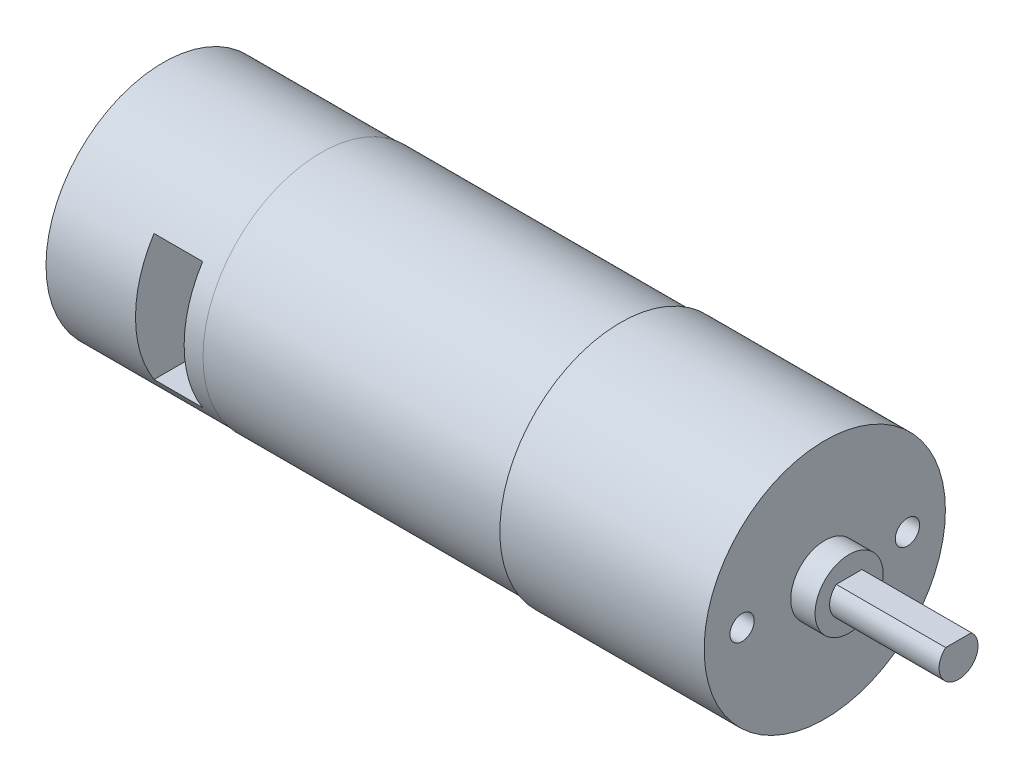
ISO-10303-21;
HEADER;
FILE_DESCRIPTION(('STEP AP214'),'2;1');
FILE_NAME('part.step','',(''),(''),'','','');
FILE_SCHEMA(('AUTOMOTIVE_DESIGN { 1 0 10303 214 1 1 1 1 }'));
ENDSEC;
DATA;
#1=APPLICATION_CONTEXT('core data for automotive mechanical design processes');
#2=APPLICATION_PROTOCOL_DEFINITION('international standard','automotive_design',2000,#1);
#3=PRODUCT_CONTEXT('',#1,'mechanical');
#4=PRODUCT('Part','Part','',(#3));
#5=PRODUCT_RELATED_PRODUCT_CATEGORY('part','',(#4));
#6=PRODUCT_DEFINITION_FORMATION('','',#4);
#7=PRODUCT_DEFINITION_CONTEXT('part definition',#1,'design');
#8=PRODUCT_DEFINITION('design','',#6,#7);
#9=PRODUCT_DEFINITION_SHAPE('','',#8);
#10=(LENGTH_UNIT() NAMED_UNIT(*) SI_UNIT(.MILLI.,.METRE.));
#11=(NAMED_UNIT(*) PLANE_ANGLE_UNIT() SI_UNIT($,.RADIAN.));
#12=(NAMED_UNIT(*) SI_UNIT($,.STERADIAN.) SOLID_ANGLE_UNIT());
#13=UNCERTAINTY_MEASURE_WITH_UNIT(LENGTH_MEASURE(1.E-05),#10,'distance_accuracy_value','');
#14=(GEOMETRIC_REPRESENTATION_CONTEXT(3) GLOBAL_UNCERTAINTY_ASSIGNED_CONTEXT((#13)) GLOBAL_UNIT_ASSIGNED_CONTEXT((#10,
#11,#12)) REPRESENTATION_CONTEXT('',''));
#15=CARTESIAN_POINT('',(0.,0.,0.));
#16=DIRECTION('',(0.,0.,1.));
#17=DIRECTION('',(1.,0.,0.));
#18=AXIS2_PLACEMENT_3D('',#15,#16,#17);
#19=CARTESIAN_POINT('',(-68.,0.,0.));
#20=DIRECTION('',(1.,0.,0.));
#21=DIRECTION('',(0.,0.,-1.));
#22=AXIS2_PLACEMENT_3D('',#19,#20,#21);
#23=CYLINDRICAL_SURFACE('',#22,12.05);
#24=CARTESIAN_POINT('',(-51.8,0.,0.));
#25=DIRECTION('',(-1.,0.,0.));
#26=DIRECTION('',(0.,0.,1.));
#27=AXIS2_PLACEMENT_3D('',#24,#25,#26);
#28=CIRCLE('',#27,12.05);
#29=CARTESIAN_POINT('',(-51.8,0.,12.05));
#30=VERTEX_POINT('',#29);
#31=EDGE_CURVE('E170',#30,#30,#28,.T.);
#32=ORIENTED_EDGE('',*,*,#31,.T.);
#33=EDGE_LOOP('',(#32));
#34=FACE_BOUND('',#33,.T.);
#35=CARTESIAN_POINT('',(-68.,0.,0.));
#36=DIRECTION('',(-1.,0.,0.));
#37=DIRECTION('',(0.,0.,1.));
#38=AXIS2_PLACEMENT_3D('',#35,#36,#37);
#39=CIRCLE('',#38,12.05);
#40=CARTESIAN_POINT('',(-68.,0.,12.05));
#41=VERTEX_POINT('',#40);
#42=EDGE_CURVE('E165',#41,#41,#39,.T.);
#43=ORIENTED_EDGE('',*,*,#42,.F.);
#44=EDGE_LOOP('',(#43));
#45=FACE_BOUND('',#44,.T.);
#46=CARTESIAN_POINT('',(-58.8,0.,0.));
#47=DIRECTION('',(1.,0.,0.));
#48=DIRECTION('',(0.,0.,-1.));
#49=AXIS2_PLACEMENT_3D('',#46,#47,#48);
#50=CIRCLE('',#49,12.05);
#51=CARTESIAN_POINT('',(-58.8,6.5,10.1465511381947));
#52=VERTEX_POINT('',#51);
#53=CARTESIAN_POINT('',(-58.8,-6.5,10.1465511381947));
#54=VERTEX_POINT('',#53);
#55=EDGE_CURVE('E11',#52,#54,#50,.T.);
#56=ORIENTED_EDGE('',*,*,#55,.F.);
#57=DIRECTION('',(1.,0.,0.));
#58=VECTOR('',#57,1.);
#59=CARTESIAN_POINT('',(-68.,6.5,10.1465511381947));
#60=LINE('',#59,#58);
#61=CARTESIAN_POINT('',(-53.8,6.5,10.1465511381947));
#62=VERTEX_POINT('',#61);
#63=EDGE_CURVE('E169',#62,#52,#60,.F.);
#64=ORIENTED_EDGE('',*,*,#63,.F.);
#65=CARTESIAN_POINT('',(-53.8,0.,0.));
#66=DIRECTION('',(-1.,0.,0.));
#67=DIRECTION('',(0.,0.,1.));
#68=AXIS2_PLACEMENT_3D('',#65,#66,#67);
#69=CIRCLE('',#68,12.05);
#70=CARTESIAN_POINT('',(-53.8,-6.5,10.1465511381947));
#71=VERTEX_POINT('',#70);
#72=EDGE_CURVE('E188',#71,#62,#69,.T.);
#73=ORIENTED_EDGE('',*,*,#72,.F.);
#74=DIRECTION('',(1.,0.,0.));
#75=VECTOR('',#74,1.);
#76=CARTESIAN_POINT('',(-68.,-6.5,10.1465511381947));
#77=LINE('',#76,#75);
#78=EDGE_CURVE('E55',#54,#71,#77,.T.);
#79=ORIENTED_EDGE('',*,*,#78,.F.);
#80=EDGE_LOOP('',(#56,#64,#73,#79));
#81=FACE_BOUND('',#80,.T.);
#82=ADVANCED_FACE('F47',(#34,#45,#81),#23,.T.);
#83=CARTESIAN_POINT('',(-21.,0.,0.));
#84=DIRECTION('',(1.,0.,0.));
#85=DIRECTION('',(0.,0.,-1.));
#86=AXIS2_PLACEMENT_3D('',#83,#84,#85);
#87=CYLINDRICAL_SURFACE('',#86,12.4);
#88=CARTESIAN_POINT('',(-21.,0.,0.));
#89=DIRECTION('',(1.,0.,0.));
#90=DIRECTION('',(0.,0.,-1.));
#91=AXIS2_PLACEMENT_3D('',#88,#89,#90);
#92=CIRCLE('',#91,12.4);
#93=CARTESIAN_POINT('',(-21.,0.,-12.4));
#94=VERTEX_POINT('',#93);
#95=EDGE_CURVE('E182',#94,#94,#92,.T.);
#96=ORIENTED_EDGE('',*,*,#95,.T.);
#97=EDGE_LOOP('',(#96));
#98=FACE_BOUND('',#97,.T.);
#99=CARTESIAN_POINT('',(0.,0.,0.));
#100=DIRECTION('',(1.,0.,0.));
#101=DIRECTION('',(0.,0.,-1.));
#102=AXIS2_PLACEMENT_3D('',#99,#100,#101);
#103=CIRCLE('',#102,12.4);
#104=CARTESIAN_POINT('',(0.,0.,-12.4));
#105=VERTEX_POINT('',#104);
#106=EDGE_CURVE('E179',#105,#105,#103,.T.);
#107=ORIENTED_EDGE('',*,*,#106,.F.);
#108=EDGE_LOOP('',(#107));
#109=FACE_BOUND('',#108,.T.);
#110=ADVANCED_FACE('F49',(#98,#109),#87,.T.);
#111=CARTESIAN_POINT('',(-21.,0.,0.));
#112=DIRECTION('',(1.,0.,0.));
#113=DIRECTION('',(0.,0.,-1.));
#114=AXIS2_PLACEMENT_3D('',#111,#112,#113);
#115=PLANE('',#114);
#116=CARTESIAN_POINT('',(-21.,0.,0.));
#117=DIRECTION('',(-1.,0.,0.));
#118=DIRECTION('',(0.,0.,1.));
#119=AXIS2_PLACEMENT_3D('',#116,#117,#118);
#120=CIRCLE('',#119,12.115);
#121=CARTESIAN_POINT('',(-21.,0.,12.115));
#122=VERTEX_POINT('',#121);
#123=EDGE_CURVE('E176',#122,#122,#120,.T.);
#124=ORIENTED_EDGE('',*,*,#123,.F.);
#125=EDGE_LOOP('',(#124));
#126=FACE_BOUND('',#125,.T.);
#127=ORIENTED_EDGE('',*,*,#95,.F.);
#128=EDGE_LOOP('',(#127));
#129=FACE_BOUND('',#128,.T.);
#130=ADVANCED_FACE('F209',(#126,#129),#115,.F.);
#131=CARTESIAN_POINT('',(0.,0.,0.));
#132=DIRECTION('',(1.,0.,0.));
#133=DIRECTION('',(0.,0.,-1.));
#134=AXIS2_PLACEMENT_3D('',#131,#132,#133);
#135=PLANE('',#134);
#136=CARTESIAN_POINT('',(0.,0.,8.5));
#137=DIRECTION('',(1.,0.,0.));
#138=DIRECTION('',(0.,0.,-1.));
#139=AXIS2_PLACEMENT_3D('',#136,#137,#138);
#140=CIRCLE('',#139,1.24999999999999);
#141=CARTESIAN_POINT('',(0.,0.,7.25000000000001));
#142=VERTEX_POINT('',#141);
#143=EDGE_CURVE('E114',#142,#142,#140,.T.);
#144=ORIENTED_EDGE('',*,*,#143,.F.);
#145=EDGE_LOOP('',(#144));
#146=FACE_BOUND('',#145,.T.);
#147=CARTESIAN_POINT('',(0.,0.,-8.5));
#148=DIRECTION('',(1.,0.,0.));
#149=DIRECTION('',(0.,0.,-1.));
#150=AXIS2_PLACEMENT_3D('',#147,#148,#149);
#151=CIRCLE('',#150,1.24999999999999);
#152=CARTESIAN_POINT('',(0.,0.,-9.74999999999999));
#153=VERTEX_POINT('',#152);
#154=EDGE_CURVE('E142',#153,#153,#151,.T.);
#155=ORIENTED_EDGE('',*,*,#154,.F.);
#156=EDGE_LOOP('',(#155));
#157=FACE_BOUND('',#156,.T.);
#158=CARTESIAN_POINT('',(0.,0.,0.));
#159=DIRECTION('',(1.,0.,0.));
#160=DIRECTION('',(0.,0.,-1.));
#161=AXIS2_PLACEMENT_3D('',#158,#159,#160);
#162=CIRCLE('',#161,3.5);
#163=CARTESIAN_POINT('',(0.,0.,-3.5));
#164=VERTEX_POINT('',#163);
#165=EDGE_CURVE('E166',#164,#164,#162,.T.);
#166=ORIENTED_EDGE('',*,*,#165,.F.);
#167=EDGE_LOOP('',(#166));
#168=FACE_BOUND('',#167,.T.);
#169=ORIENTED_EDGE('',*,*,#106,.T.);
#170=EDGE_LOOP('',(#169));
#171=FACE_BOUND('',#170,.T.);
#172=ADVANCED_FACE('F223',(#146,#157,#168,#171),#135,.T.);
#173=CARTESIAN_POINT('',(-51.8,0.,0.));
#174=DIRECTION('',(1.,0.,0.));
#175=DIRECTION('',(0.,0.,-1.));
#176=AXIS2_PLACEMENT_3D('',#173,#174,#175);
#177=CYLINDRICAL_SURFACE('',#176,12.115);
#178=CARTESIAN_POINT('',(-51.8,0.,0.));
#179=DIRECTION('',(-1.,0.,0.));
#180=DIRECTION('',(0.,0.,1.));
#181=AXIS2_PLACEMENT_3D('',#178,#179,#180);
#182=CIRCLE('',#181,12.115);
#183=CARTESIAN_POINT('',(-51.8,0.,12.115));
#184=VERTEX_POINT('',#183);
#185=EDGE_CURVE('E173',#184,#184,#182,.T.);
#186=ORIENTED_EDGE('',*,*,#185,.F.);
#187=EDGE_LOOP('',(#186));
#188=FACE_BOUND('',#187,.T.);
#189=ORIENTED_EDGE('',*,*,#123,.T.);
#190=EDGE_LOOP('',(#189));
#191=FACE_BOUND('',#190,.T.);
#192=ADVANCED_FACE('F219',(#188,#191),#177,.T.);
#193=CARTESIAN_POINT('',(-51.8,0.,0.));
#194=DIRECTION('',(-1.,0.,0.));
#195=DIRECTION('',(0.,0.,1.));
#196=AXIS2_PLACEMENT_3D('',#193,#194,#195);
#197=PLANE('',#196);
#198=ORIENTED_EDGE('',*,*,#31,.F.);
#199=EDGE_LOOP('',(#198));
#200=FACE_BOUND('',#199,.T.);
#201=ORIENTED_EDGE('',*,*,#185,.T.);
#202=EDGE_LOOP('',(#201));
#203=FACE_BOUND('',#202,.T.);
#204=ADVANCED_FACE('F216',(#200,#203),#197,.T.);
#205=CARTESIAN_POINT('',(-68.,0.,0.));
#206=DIRECTION('',(-1.,0.,0.));
#207=DIRECTION('',(0.,0.,1.));
#208=AXIS2_PLACEMENT_3D('',#205,#206,#207);
#209=PLANE('',#208);
#210=ORIENTED_EDGE('',*,*,#42,.T.);
#211=EDGE_LOOP('',(#210));
#212=FACE_BOUND('',#211,.T.);
#213=ADVANCED_FACE('F214',(#212),#209,.T.);
#214=CARTESIAN_POINT('',(2.5,0.,0.));
#215=DIRECTION('',(-1.,0.,0.));
#216=DIRECTION('',(0.,0.,1.));
#217=AXIS2_PLACEMENT_3D('',#214,#215,#216);
#218=CYLINDRICAL_SURFACE('',#217,3.5);
#219=CARTESIAN_POINT('',(2.5,0.,0.));
#220=DIRECTION('',(1.,0.,0.));
#221=DIRECTION('',(0.,0.,-1.));
#222=AXIS2_PLACEMENT_3D('',#219,#220,#221);
#223=CIRCLE('',#222,3.5);
#224=CARTESIAN_POINT('',(2.5,0.,-3.5));
#225=VERTEX_POINT('',#224);
#226=EDGE_CURVE('E162',#225,#225,#223,.T.);
#227=ORIENTED_EDGE('',*,*,#226,.F.);
#228=EDGE_LOOP('',(#227));
#229=FACE_BOUND('',#228,.T.);
#230=ORIENTED_EDGE('',*,*,#165,.T.);
#231=EDGE_LOOP('',(#230));
#232=FACE_BOUND('',#231,.T.);
#233=ADVANCED_FACE('F240',(#229,#232),#218,.T.);
#234=CARTESIAN_POINT('',(2.5,0.,0.));
#235=DIRECTION('',(1.,0.,0.));
#236=DIRECTION('',(0.,0.,-1.));
#237=AXIS2_PLACEMENT_3D('',#234,#235,#236);
#238=PLANE('',#237);
#239=CARTESIAN_POINT('',(2.5,0.,0.));
#240=DIRECTION('',(1.,0.,0.));
#241=DIRECTION('',(0.,0.,-1.));
#242=AXIS2_PLACEMENT_3D('',#239,#240,#241);
#243=CIRCLE('',#242,2.);
#244=CARTESIAN_POINT('',(2.5,1.5,1.3228756555323));
#245=VERTEX_POINT('',#244);
#246=CARTESIAN_POINT('',(2.5,1.5,-1.3228756555323));
#247=VERTEX_POINT('',#246);
#248=EDGE_CURVE('E148',#245,#247,#243,.T.);
#249=ORIENTED_EDGE('',*,*,#248,.F.);
#250=DIRECTION('',(0.,0.,1.));
#251=VECTOR('',#250,1.);
#252=CARTESIAN_POINT('',(2.5,1.5,1.3228756555323));
#253=LINE('',#252,#251);
#254=EDGE_CURVE('E69',#247,#245,#253,.T.);
#255=ORIENTED_EDGE('',*,*,#254,.F.);
#256=EDGE_LOOP('',(#249,#255));
#257=FACE_BOUND('',#256,.T.);
#258=ORIENTED_EDGE('',*,*,#226,.T.);
#259=EDGE_LOOP('',(#258));
#260=FACE_BOUND('',#259,.T.);
#261=ADVANCED_FACE('F242',(#257,#260),#238,.T.);
#262=CARTESIAN_POINT('',(13.75,0.,0.));
#263=DIRECTION('',(-1.,0.,0.));
#264=DIRECTION('',(0.,0.,1.));
#265=AXIS2_PLACEMENT_3D('',#262,#263,#264);
#266=CYLINDRICAL_SURFACE('',#265,2.);
#267=ORIENTED_EDGE('',*,*,#248,.T.);
#268=DIRECTION('',(-1.,0.,0.));
#269=VECTOR('',#268,1.);
#270=CARTESIAN_POINT('',(13.75,1.5,-1.3228756555323));
#271=LINE('',#270,#269);
#272=CARTESIAN_POINT('',(13.75,1.5,-1.3228756555323));
#273=VERTEX_POINT('',#272);
#274=EDGE_CURVE('E160',#273,#247,#271,.T.);
#275=ORIENTED_EDGE('',*,*,#274,.F.);
#276=CARTESIAN_POINT('',(13.75,0.,0.));
#277=DIRECTION('',(1.,0.,0.));
#278=DIRECTION('',(0.,0.,-1.));
#279=AXIS2_PLACEMENT_3D('',#276,#277,#278);
#280=CIRCLE('',#279,2.);
#281=CARTESIAN_POINT('',(13.75,1.5,1.3228756555323));
#282=VERTEX_POINT('',#281);
#283=EDGE_CURVE('E149',#282,#273,#280,.T.);
#284=ORIENTED_EDGE('',*,*,#283,.F.);
#285=DIRECTION('',(-1.,0.,0.));
#286=VECTOR('',#285,1.);
#287=CARTESIAN_POINT('',(13.75,1.5,1.3228756555323));
#288=LINE('',#287,#286);
#289=EDGE_CURVE('E154',#282,#245,#288,.T.);
#290=ORIENTED_EDGE('',*,*,#289,.T.);
#291=EDGE_LOOP('',(#267,#275,#284,#290));
#292=FACE_BOUND('',#291,.T.);
#293=ADVANCED_FACE('F248',(#292),#266,.T.);
#294=CARTESIAN_POINT('',(13.75,1.5,1.3228756555323));
#295=DIRECTION('',(0.,-1.,0.));
#296=DIRECTION('',(0.,0.,-1.));
#297=AXIS2_PLACEMENT_3D('',#294,#295,#296);
#298=PLANE('',#297);
#299=ORIENTED_EDGE('',*,*,#254,.T.);
#300=ORIENTED_EDGE('',*,*,#289,.F.);
#301=DIRECTION('',(0.,0.,1.));
#302=VECTOR('',#301,1.);
#303=CARTESIAN_POINT('',(13.75,1.5,1.3228756555323));
#304=LINE('',#303,#302);
#305=EDGE_CURVE('E152',#273,#282,#304,.T.);
#306=ORIENTED_EDGE('',*,*,#305,.F.);
#307=ORIENTED_EDGE('',*,*,#274,.T.);
#308=EDGE_LOOP('',(#299,#300,#306,#307));
#309=FACE_BOUND('',#308,.T.);
#310=ADVANCED_FACE('F256',(#309),#298,.F.);
#311=CARTESIAN_POINT('',(13.75,0.,0.));
#312=DIRECTION('',(1.,0.,0.));
#313=DIRECTION('',(0.,0.,-1.));
#314=AXIS2_PLACEMENT_3D('',#311,#312,#313);
#315=PLANE('',#314);
#316=ORIENTED_EDGE('',*,*,#283,.T.);
#317=ORIENTED_EDGE('',*,*,#305,.T.);
#318=EDGE_LOOP('',(#316,#317));
#319=FACE_BOUND('',#318,.T.);
#320=ADVANCED_FACE('F260',(#319),#315,.T.);
#321=CARTESIAN_POINT('',(-4.,0.,-8.5));
#322=DIRECTION('',(1.,0.,0.));
#323=DIRECTION('',(0.,0.,-1.));
#324=AXIS2_PLACEMENT_3D('',#321,#322,#323);
#325=CONICAL_SURFACE('',#324,1.25,1.02974425867665);
#326=CARTESIAN_POINT('',(-4.75107577378445,0.,-8.5));
#327=VERTEX_POINT('',#326);
#328=VERTEX_LOOP('',#327);
#329=FACE_BOUND('',#328,.T.);
#330=CARTESIAN_POINT('',(-4.,0.,-8.5));
#331=DIRECTION('',(1.,0.,0.));
#332=DIRECTION('',(0.,0.,-1.));
#333=AXIS2_PLACEMENT_3D('',#330,#331,#332);
#334=CIRCLE('',#333,1.25);
#335=CARTESIAN_POINT('',(-4.,0.,-9.75));
#336=VERTEX_POINT('',#335);
#337=EDGE_CURVE('E145',#336,#336,#334,.T.);
#338=ORIENTED_EDGE('',*,*,#337,.T.);
#339=EDGE_LOOP('',(#338));
#340=FACE_BOUND('',#339,.T.);
#341=ADVANCED_FACE('F264',(#329,#340),#325,.F.);
#342=CARTESIAN_POINT('',(0.,0.,-8.5));
#343=DIRECTION('',(1.,0.,0.));
#344=DIRECTION('',(0.,0.,-1.));
#345=AXIS2_PLACEMENT_3D('',#342,#343,#344);
#346=CYLINDRICAL_SURFACE('',#345,1.24999999999999);
#347=ORIENTED_EDGE('',*,*,#337,.F.);
#348=EDGE_LOOP('',(#347));
#349=FACE_BOUND('',#348,.T.);
#350=ORIENTED_EDGE('',*,*,#154,.T.);
#351=EDGE_LOOP('',(#350));
#352=FACE_BOUND('',#351,.T.);
#353=ADVANCED_FACE('F268',(#349,#352),#346,.F.);
#354=CARTESIAN_POINT('',(-4.,0.,8.5));
#355=DIRECTION('',(1.,0.,0.));
#356=DIRECTION('',(0.,0.,-1.));
#357=AXIS2_PLACEMENT_3D('',#354,#355,#356);
#358=CONICAL_SURFACE('',#357,1.25,1.02974425867665);
#359=CARTESIAN_POINT('',(-4.75107577378445,0.,8.5));
#360=VERTEX_POINT('',#359);
#361=VERTEX_LOOP('',#360);
#362=FACE_BOUND('',#361,.T.);
#363=CARTESIAN_POINT('',(-4.,0.,8.5));
#364=DIRECTION('',(1.,0.,0.));
#365=DIRECTION('',(0.,0.,-1.));
#366=AXIS2_PLACEMENT_3D('',#363,#364,#365);
#367=CIRCLE('',#366,1.25);
#368=CARTESIAN_POINT('',(-4.,0.,7.25));
#369=VERTEX_POINT('',#368);
#370=EDGE_CURVE('E139',#369,#369,#367,.T.);
#371=ORIENTED_EDGE('',*,*,#370,.T.);
#372=EDGE_LOOP('',(#371));
#373=FACE_BOUND('',#372,.T.);
#374=ADVANCED_FACE('F272',(#362,#373),#358,.F.);
#375=CARTESIAN_POINT('',(0.,0.,8.5));
#376=DIRECTION('',(1.,0.,0.));
#377=DIRECTION('',(0.,0.,-1.));
#378=AXIS2_PLACEMENT_3D('',#375,#376,#377);
#379=CYLINDRICAL_SURFACE('',#378,1.24999999999999);
#380=ORIENTED_EDGE('',*,*,#370,.F.);
#381=EDGE_LOOP('',(#380));
#382=FACE_BOUND('',#381,.T.);
#383=ORIENTED_EDGE('',*,*,#143,.T.);
#384=EDGE_LOOP('',(#383));
#385=FACE_BOUND('',#384,.T.);
#386=ADVANCED_FACE('F276',(#382,#385),#379,.F.);
#387=CARTESIAN_POINT('',(-58.8,6.5,12.4));
#388=DIRECTION('',(1.,0.,0.));
#389=DIRECTION('',(0.,0.,-1.));
#390=AXIS2_PLACEMENT_3D('',#387,#388,#389);
#391=PLANE('',#390);
#392=ORIENTED_EDGE('',*,*,#55,.T.);
#393=DIRECTION('',(0.,0.,-1.));
#394=VECTOR('',#393,1.);
#395=CARTESIAN_POINT('',(-58.8,-6.5,12.4));
#396=LINE('',#395,#394);
#397=CARTESIAN_POINT('',(-58.8,-6.5,0.));
#398=VERTEX_POINT('',#397);
#399=EDGE_CURVE('E105',#54,#398,#396,.T.);
#400=ORIENTED_EDGE('',*,*,#399,.T.);
#401=DIRECTION('',(0.,-1.,0.));
#402=VECTOR('',#401,1.);
#403=CARTESIAN_POINT('',(-58.8,6.5,0.));
#404=LINE('',#403,#402);
#405=CARTESIAN_POINT('',(-58.8,6.5,0.));
#406=VERTEX_POINT('',#405);
#407=EDGE_CURVE('E110',#406,#398,#404,.T.);
#408=ORIENTED_EDGE('',*,*,#407,.F.);
#409=DIRECTION('',(0.,0.,-1.));
#410=VECTOR('',#409,1.);
#411=CARTESIAN_POINT('',(-58.8,6.5,12.4));
#412=LINE('',#411,#410);
#413=EDGE_CURVE('E133',#52,#406,#412,.T.);
#414=ORIENTED_EDGE('',*,*,#413,.F.);
#415=EDGE_LOOP('',(#392,#400,#408,#414));
#416=FACE_BOUND('',#415,.T.);
#417=ADVANCED_FACE('F107',(#416),#391,.T.);
#418=CARTESIAN_POINT('',(-58.8,-6.5,12.4));
#419=DIRECTION('',(0.,1.,0.));
#420=DIRECTION('',(-1.,0.,0.));
#421=AXIS2_PLACEMENT_3D('',#418,#419,#420);
#422=PLANE('',#421);
#423=ORIENTED_EDGE('',*,*,#78,.T.);
#424=DIRECTION('',(0.,0.,-1.));
#425=VECTOR('',#424,1.);
#426=CARTESIAN_POINT('',(-53.8,-6.5,12.4));
#427=LINE('',#426,#425);
#428=CARTESIAN_POINT('',(-53.8,-6.5,0.));
#429=VERTEX_POINT('',#428);
#430=EDGE_CURVE('E115',#71,#429,#427,.T.);
#431=ORIENTED_EDGE('',*,*,#430,.T.);
#432=DIRECTION('',(1.,0.,0.));
#433=VECTOR('',#432,1.);
#434=CARTESIAN_POINT('',(-58.8,-6.5,0.));
#435=LINE('',#434,#433);
#436=EDGE_CURVE('E118',#398,#429,#435,.T.);
#437=ORIENTED_EDGE('',*,*,#436,.F.);
#438=ORIENTED_EDGE('',*,*,#399,.F.);
#439=EDGE_LOOP('',(#423,#431,#437,#438));
#440=FACE_BOUND('',#439,.T.);
#441=ADVANCED_FACE('F119',(#440),#422,.T.);
#442=CARTESIAN_POINT('',(-53.8,6.5,12.4));
#443=DIRECTION('',(-1.,0.,0.));
#444=DIRECTION('',(0.,0.,1.));
#445=AXIS2_PLACEMENT_3D('',#442,#443,#444);
#446=PLANE('',#445);
#447=ORIENTED_EDGE('',*,*,#72,.T.);
#448=DIRECTION('',(0.,0.,-1.));
#449=VECTOR('',#448,1.);
#450=CARTESIAN_POINT('',(-53.8,6.5,12.4));
#451=LINE('',#450,#449);
#452=CARTESIAN_POINT('',(-53.8,6.5,0.));
#453=VERTEX_POINT('',#452);
#454=EDGE_CURVE('E62',#62,#453,#451,.T.);
#455=ORIENTED_EDGE('',*,*,#454,.T.);
#456=DIRECTION('',(0.,1.,0.));
#457=VECTOR('',#456,1.);
#458=CARTESIAN_POINT('',(-53.8,6.5,0.));
#459=LINE('',#458,#457);
#460=EDGE_CURVE('E124',#429,#453,#459,.T.);
#461=ORIENTED_EDGE('',*,*,#460,.F.);
#462=ORIENTED_EDGE('',*,*,#430,.F.);
#463=EDGE_LOOP('',(#447,#455,#461,#462));
#464=FACE_BOUND('',#463,.T.);
#465=ADVANCED_FACE('F192',(#464),#446,.T.);
#466=CARTESIAN_POINT('',(-58.8,6.5,12.4));
#467=DIRECTION('',(0.,-1.,0.));
#468=DIRECTION('',(1.,0.,0.));
#469=AXIS2_PLACEMENT_3D('',#466,#467,#468);
#470=PLANE('',#469);
#471=ORIENTED_EDGE('',*,*,#63,.T.);
#472=ORIENTED_EDGE('',*,*,#413,.T.);
#473=DIRECTION('',(-1.,0.,0.));
#474=VECTOR('',#473,1.);
#475=CARTESIAN_POINT('',(-58.8,6.5,0.));
#476=LINE('',#475,#474);
#477=EDGE_CURVE('E128',#453,#406,#476,.T.);
#478=ORIENTED_EDGE('',*,*,#477,.F.);
#479=ORIENTED_EDGE('',*,*,#454,.F.);
#480=EDGE_LOOP('',(#471,#472,#478,#479));
#481=FACE_BOUND('',#480,.T.);
#482=ADVANCED_FACE('F194',(#481),#470,.T.);
#483=CARTESIAN_POINT('',(0.,0.,0.));
#484=DIRECTION('',(0.,0.,1.));
#485=DIRECTION('',(1.,0.,0.));
#486=AXIS2_PLACEMENT_3D('',#483,#484,#485);
#487=PLANE('',#486);
#488=ORIENTED_EDGE('',*,*,#407,.T.);
#489=ORIENTED_EDGE('',*,*,#436,.T.);
#490=ORIENTED_EDGE('',*,*,#460,.T.);
#491=ORIENTED_EDGE('',*,*,#477,.T.);
#492=EDGE_LOOP('',(#488,#489,#490,#491));
#493=FACE_BOUND('',#492,.T.);
#494=ADVANCED_FACE('F127',(#493),#487,.T.);
#495=CLOSED_SHELL('',(#82,#110,#130,#172,#192,#204,#213,#233,#261,#293,#310,#320,#341,#353,#374,
#386,#417,#441,#465,#482,#494));
#496=MANIFOLD_SOLID_BREP('B2',#495);
#497=ADVANCED_BREP_SHAPE_REPRESENTATION('',(#18,#496),#14);
#498=SHAPE_DEFINITION_REPRESENTATION(#9,#497);
ENDSEC;
END-ISO-10303-21;
